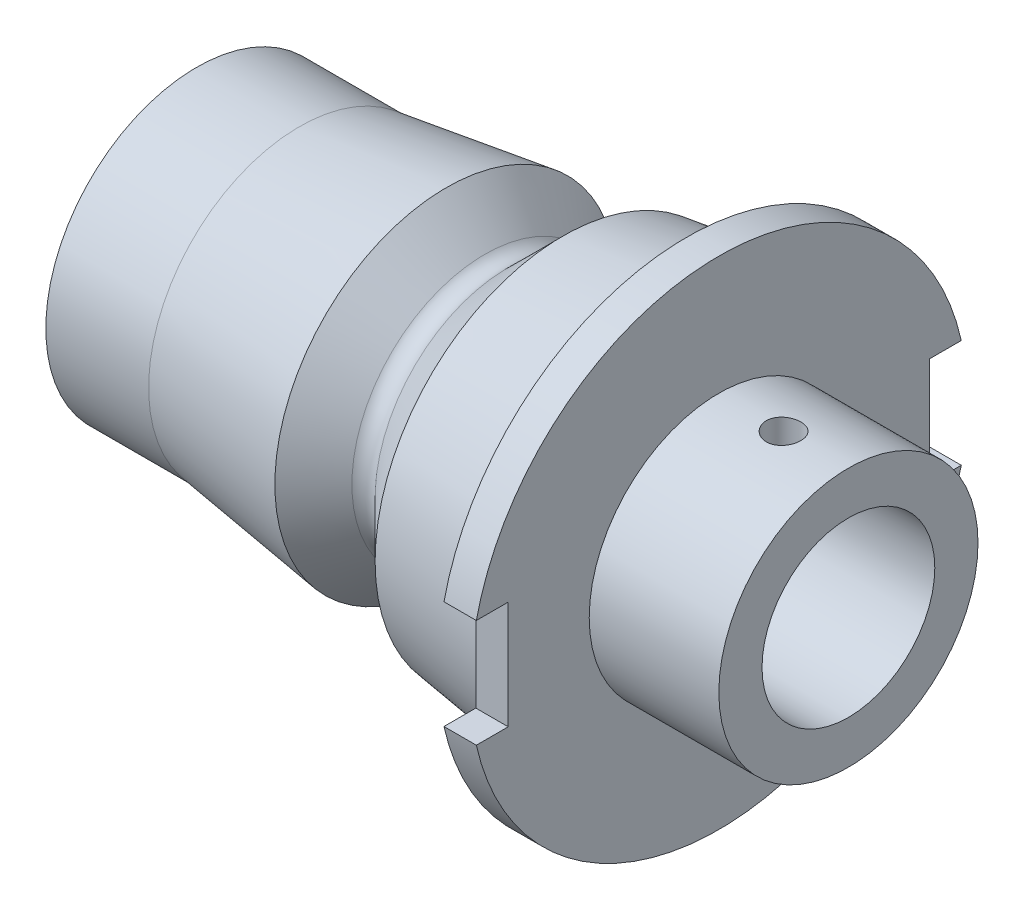
ISO-10303-21;
HEADER;
FILE_DESCRIPTION(('STEP AP214'),'2;1');
FILE_NAME('part.step','',(''),(''),'','','');
FILE_SCHEMA(('AUTOMOTIVE_DESIGN { 1 0 10303 214 1 1 1 1 }'));
ENDSEC;
DATA;
#1=APPLICATION_CONTEXT('core data for automotive mechanical design processes');
#2=APPLICATION_PROTOCOL_DEFINITION('international standard','automotive_design',2000,#1);
#3=PRODUCT_CONTEXT('',#1,'mechanical');
#4=PRODUCT('Part','Part','',(#3));
#5=PRODUCT_RELATED_PRODUCT_CATEGORY('part','',(#4));
#6=PRODUCT_DEFINITION_FORMATION('','',#4);
#7=PRODUCT_DEFINITION_CONTEXT('part definition',#1,'design');
#8=PRODUCT_DEFINITION('design','',#6,#7);
#9=PRODUCT_DEFINITION_SHAPE('','',#8);
#10=(LENGTH_UNIT() NAMED_UNIT(*) SI_UNIT(.MILLI.,.METRE.));
#11=(NAMED_UNIT(*) PLANE_ANGLE_UNIT() SI_UNIT($,.RADIAN.));
#12=(NAMED_UNIT(*) SI_UNIT($,.STERADIAN.) SOLID_ANGLE_UNIT());
#13=UNCERTAINTY_MEASURE_WITH_UNIT(LENGTH_MEASURE(1.E-05),#10,'distance_accuracy_value','');
#14=(GEOMETRIC_REPRESENTATION_CONTEXT(3) GLOBAL_UNCERTAINTY_ASSIGNED_CONTEXT((#13)) GLOBAL_UNIT_ASSIGNED_CONTEXT((#10,
#11,#12)) REPRESENTATION_CONTEXT('',''));
#15=CARTESIAN_POINT('',(0.,0.,0.));
#16=DIRECTION('',(0.,0.,1.));
#17=DIRECTION('',(1.,0.,0.));
#18=AXIS2_PLACEMENT_3D('',#15,#16,#17);
#19=CARTESIAN_POINT('',(24.1765009609634,0.,0.));
#20=DIRECTION('',(1.,0.,0.));
#21=DIRECTION('',(0.,0.,-1.));
#22=AXIS2_PLACEMENT_3D('',#19,#20,#21);
#23=CYLINDRICAL_SURFACE('',#22,11.5);
#24=DIRECTION('',(1.,0.,0.));
#25=VECTOR('',#24,1.);
#26=CARTESIAN_POINT('',(24.1765009609634,2.5,11.2249721603218));
#27=LINE('',#26,#25);
#28=CARTESIAN_POINT('',(24.1765009609634,2.5,11.2249721603218));
#29=VERTEX_POINT('',#28);
#30=CARTESIAN_POINT('',(22.6765009609634,2.5,11.2249721603218));
#31=VERTEX_POINT('',#30);
#32=EDGE_CURVE('E132',#29,#31,#27,.F.);
#33=ORIENTED_EDGE('',*,*,#32,.F.);
#34=CARTESIAN_POINT('',(24.1765009609634,0.,0.));
#35=DIRECTION('',(1.,0.,0.));
#36=DIRECTION('',(0.,0.,-1.));
#37=AXIS2_PLACEMENT_3D('',#34,#35,#36);
#38=CIRCLE('',#37,11.5);
#39=CARTESIAN_POINT('',(24.1765009609634,2.5,-11.2249721603218));
#40=VERTEX_POINT('',#39);
#41=EDGE_CURVE('E156',#40,#29,#38,.T.);
#42=ORIENTED_EDGE('',*,*,#41,.F.);
#43=DIRECTION('',(1.,0.,0.));
#44=VECTOR('',#43,1.);
#45=CARTESIAN_POINT('',(24.1765009609634,2.5,-11.2249721603218));
#46=LINE('',#45,#44);
#47=CARTESIAN_POINT('',(22.6765009609634,2.5,-11.2249721603218));
#48=VERTEX_POINT('',#47);
#49=EDGE_CURVE('E149',#48,#40,#46,.T.);
#50=ORIENTED_EDGE('',*,*,#49,.F.);
#51=CARTESIAN_POINT('',(22.6765009609634,0.,0.));
#52=DIRECTION('',(1.,0.,0.));
#53=DIRECTION('',(0.,0.,-1.));
#54=AXIS2_PLACEMENT_3D('',#51,#52,#53);
#55=CIRCLE('',#54,11.5);
#56=EDGE_CURVE('E159',#48,#31,#55,.T.);
#57=ORIENTED_EDGE('',*,*,#56,.T.);
#58=EDGE_LOOP('',(#33,#42,#50,#57));
#59=FACE_BOUND('',#58,.T.);
#60=ADVANCED_FACE('F35',(#59),#23,.T.);
#61=CARTESIAN_POINT('',(0.,0.,0.));
#62=DIRECTION('',(-1.,0.,0.));
#63=DIRECTION('',(0.,0.,1.));
#64=AXIS2_PLACEMENT_3D('',#61,#62,#63);
#65=PLANE('',#64);
#66=CARTESIAN_POINT('',(0.,0.,0.));
#67=DIRECTION('',(-1.,0.,0.));
#68=DIRECTION('',(0.,0.,1.));
#69=AXIS2_PLACEMENT_3D('',#66,#67,#68);
#70=CIRCLE('',#69,4.);
#71=CARTESIAN_POINT('',(0.,0.,4.));
#72=VERTEX_POINT('',#71);
#73=EDGE_CURVE('E39',#72,#72,#70,.T.);
#74=ORIENTED_EDGE('',*,*,#73,.F.);
#75=EDGE_LOOP('',(#74));
#76=FACE_BOUND('',#75,.T.);
#77=CARTESIAN_POINT('',(0.,0.,0.));
#78=DIRECTION('',(1.,0.,0.));
#79=DIRECTION('',(0.,0.,-1.));
#80=AXIS2_PLACEMENT_3D('',#77,#78,#79);
#81=CIRCLE('',#80,6.982);
#82=CARTESIAN_POINT('',(0.,0.,-6.982));
#83=VERTEX_POINT('',#82);
#84=EDGE_CURVE('E180',#83,#83,#81,.T.);
#85=ORIENTED_EDGE('',*,*,#84,.F.);
#86=EDGE_LOOP('',(#85));
#87=FACE_BOUND('',#86,.T.);
#88=ADVANCED_FACE('F37',(#76,#87),#65,.T.);
#89=CARTESIAN_POINT('',(24.1765009609634,0.,0.));
#90=DIRECTION('',(1.,0.,0.));
#91=DIRECTION('',(0.,0.,-1.));
#92=AXIS2_PLACEMENT_3D('',#89,#90,#91);
#93=CYLINDRICAL_SURFACE('',#92,6.982);
#94=ORIENTED_EDGE('',*,*,#84,.T.);
#95=EDGE_LOOP('',(#94));
#96=FACE_BOUND('',#95,.T.);
#97=CARTESIAN_POINT('',(4.76,0.,0.));
#98=DIRECTION('',(1.,0.,0.));
#99=DIRECTION('',(0.,0.,-1.));
#100=AXIS2_PLACEMENT_3D('',#97,#98,#99);
#101=CIRCLE('',#100,6.982);
#102=CARTESIAN_POINT('',(4.76,0.,-6.982));
#103=VERTEX_POINT('',#102);
#104=EDGE_CURVE('E177',#103,#103,#101,.T.);
#105=ORIENTED_EDGE('',*,*,#104,.F.);
#106=EDGE_LOOP('',(#105));
#107=FACE_BOUND('',#106,.T.);
#108=ADVANCED_FACE('F221',(#96,#107),#93,.T.);
#109=CARTESIAN_POINT('',(11.56,0.,0.));
#110=DIRECTION('',(1.,0.,0.));
#111=DIRECTION('',(0.,0.,-1.));
#112=AXIS2_PLACEMENT_3D('',#109,#110,#111);
#113=CONICAL_SURFACE('',#112,7.93767767597627,0.139626340159547);
#114=ORIENTED_EDGE('',*,*,#104,.T.);
#115=EDGE_LOOP('',(#114));
#116=FACE_BOUND('',#115,.T.);
#117=CARTESIAN_POINT('',(11.56,0.,0.));
#118=DIRECTION('',(1.,0.,0.));
#119=DIRECTION('',(0.,0.,-1.));
#120=AXIS2_PLACEMENT_3D('',#117,#118,#119);
#121=CIRCLE('',#120,7.93767767597627);
#122=CARTESIAN_POINT('',(11.56,0.,-7.93767767597627));
#123=VERTEX_POINT('',#122);
#124=EDGE_CURVE('E174',#123,#123,#121,.T.);
#125=ORIENTED_EDGE('',*,*,#124,.F.);
#126=EDGE_LOOP('',(#125));
#127=FACE_BOUND('',#126,.T.);
#128=ADVANCED_FACE('F247',(#116,#127),#113,.T.);
#129=CARTESIAN_POINT('',(13.3431385926017,0.,0.));
#130=DIRECTION('',(-1.,0.,0.));
#131=DIRECTION('',(0.,0.,1.));
#132=AXIS2_PLACEMENT_3D('',#129,#130,#131);
#133=CONICAL_SURFACE('',#132,6.1545390833745,0.785398163397452);
#134=ORIENTED_EDGE('',*,*,#124,.T.);
#135=EDGE_LOOP('',(#134));
#136=FACE_BOUND('',#135,.T.);
#137=CARTESIAN_POINT('',(13.3431385926017,0.,0.));
#138=DIRECTION('',(1.,0.,0.));
#139=DIRECTION('',(0.,0.,-1.));
#140=AXIS2_PLACEMENT_3D('',#137,#138,#139);
#141=CIRCLE('',#140,6.1545390833745);
#142=CARTESIAN_POINT('',(13.3431385926017,0.,-6.1545390833745));
#143=VERTEX_POINT('',#142);
#144=EDGE_CURVE('E171',#143,#143,#141,.T.);
#145=ORIENTED_EDGE('',*,*,#144,.F.);
#146=EDGE_LOOP('',(#145));
#147=FACE_BOUND('',#146,.T.);
#148=ADVANCED_FACE('F243',(#136,#147),#133,.T.);
#149=CARTESIAN_POINT('',(13.8805397463036,0.,0.));
#150=DIRECTION('',(1.,0.,0.));
#151=DIRECTION('',(0.,0.,-1.));
#152=AXIS2_PLACEMENT_3D('',#149,#150,#151);
#153=TOROIDAL_SURFACE('',#152,6.69194023707633,0.76000000000004);
#154=ORIENTED_EDGE('',*,*,#144,.T.);
#155=EDGE_LOOP('',(#154));
#156=FACE_BOUND('',#155,.T.);
#157=CARTESIAN_POINT('',(14.4179409000054,0.,0.));
#158=DIRECTION('',(1.,0.,0.));
#159=DIRECTION('',(0.,0.,-1.));
#160=AXIS2_PLACEMENT_3D('',#157,#158,#159);
#161=CIRCLE('',#160,6.15453908337452);
#162=CARTESIAN_POINT('',(14.4179409000054,0.,-6.15453908337452));
#163=VERTEX_POINT('',#162);
#164=EDGE_CURVE('E168',#163,#163,#161,.T.);
#165=ORIENTED_EDGE('',*,*,#164,.F.);
#166=EDGE_LOOP('',(#165));
#167=FACE_BOUND('',#166,.T.);
#168=ADVANCED_FACE('F239',(#156,#167),#153,.F.);
#169=CARTESIAN_POINT('',(16.96,0.,0.));
#170=DIRECTION('',(1.,0.,0.));
#171=DIRECTION('',(0.,0.,-1.));
#172=AXIS2_PLACEMENT_3D('',#169,#170,#171);
#173=CONICAL_SURFACE('',#172,8.69659818336918,0.785398163397454);
#174=ORIENTED_EDGE('',*,*,#164,.T.);
#175=EDGE_LOOP('',(#174));
#176=FACE_BOUND('',#175,.T.);
#177=CARTESIAN_POINT('',(16.96,0.,0.));
#178=DIRECTION('',(1.,0.,0.));
#179=DIRECTION('',(0.,0.,-1.));
#180=AXIS2_PLACEMENT_3D('',#177,#178,#179);
#181=CIRCLE('',#180,8.69659818336918);
#182=CARTESIAN_POINT('',(16.96,0.,-8.69659818336918));
#183=VERTEX_POINT('',#182);
#184=EDGE_CURVE('E165',#183,#183,#181,.T.);
#185=ORIENTED_EDGE('',*,*,#184,.F.);
#186=EDGE_LOOP('',(#185));
#187=FACE_BOUND('',#186,.T.);
#188=ADVANCED_FACE('F233',(#176,#187),#173,.T.);
#189=CARTESIAN_POINT('',(22.6765009609634,0.,0.));
#190=DIRECTION('',(1.,0.,0.));
#191=DIRECTION('',(0.,0.,-1.));
#192=AXIS2_PLACEMENT_3D('',#189,#190,#191);
#193=CONICAL_SURFACE('',#192,9.5,0.139626340159547);
#194=ORIENTED_EDGE('',*,*,#184,.T.);
#195=EDGE_LOOP('',(#194));
#196=FACE_BOUND('',#195,.T.);
#197=CARTESIAN_POINT('',(22.6765009609634,0.,0.));
#198=DIRECTION('',(1.,0.,0.));
#199=DIRECTION('',(0.,0.,-1.));
#200=AXIS2_PLACEMENT_3D('',#197,#198,#199);
#201=CIRCLE('',#200,9.5);
#202=CARTESIAN_POINT('',(22.6765009609634,0.,-9.5));
#203=VERTEX_POINT('',#202);
#204=EDGE_CURVE('E162',#203,#203,#201,.T.);
#205=ORIENTED_EDGE('',*,*,#204,.F.);
#206=EDGE_LOOP('',(#205));
#207=FACE_BOUND('',#206,.T.);
#208=ADVANCED_FACE('F229',(#196,#207),#193,.T.);
#209=CARTESIAN_POINT('',(22.6765009609634,9.5,0.));
#210=DIRECTION('',(-1.,0.,0.));
#211=DIRECTION('',(0.,0.,1.));
#212=AXIS2_PLACEMENT_3D('',#209,#210,#211);
#213=PLANE('',#212);
#214=DIRECTION('',(0.,0.,-1.));
#215=VECTOR('',#214,1.);
#216=CARTESIAN_POINT('',(22.6765009609634,2.5,0.));
#217=LINE('',#216,#215);
#218=CARTESIAN_POINT('',(22.6765009609634,2.5,9.75));
#219=VERTEX_POINT('',#218);
#220=EDGE_CURVE('E134',#31,#219,#217,.T.);
#221=ORIENTED_EDGE('',*,*,#220,.F.);
#222=ORIENTED_EDGE('',*,*,#56,.F.);
#223=DIRECTION('',(0.,0.,-1.));
#224=VECTOR('',#223,1.);
#225=CARTESIAN_POINT('',(22.6765009609634,2.5,0.));
#226=LINE('',#225,#224);
#227=CARTESIAN_POINT('',(22.6765009609634,2.5,-9.75));
#228=VERTEX_POINT('',#227);
#229=EDGE_CURVE('E151',#228,#48,#226,.T.);
#230=ORIENTED_EDGE('',*,*,#229,.F.);
#231=DIRECTION('',(0.,1.,0.));
#232=VECTOR('',#231,1.);
#233=CARTESIAN_POINT('',(22.6765009609634,9.5,-9.75));
#234=LINE('',#233,#232);
#235=CARTESIAN_POINT('',(22.6765009609634,-2.5,-9.75));
#236=VERTEX_POINT('',#235);
#237=EDGE_CURVE('E153',#236,#228,#234,.T.);
#238=ORIENTED_EDGE('',*,*,#237,.F.);
#239=DIRECTION('',(0.,0.,1.));
#240=VECTOR('',#239,1.);
#241=CARTESIAN_POINT('',(22.6765009609634,-2.5,0.));
#242=LINE('',#241,#240);
#243=CARTESIAN_POINT('',(22.6765009609634,-2.5,-11.2249721603218));
#244=VERTEX_POINT('',#243);
#245=EDGE_CURVE('E147',#244,#236,#242,.T.);
#246=ORIENTED_EDGE('',*,*,#245,.F.);
#247=CARTESIAN_POINT('',(22.6765009609634,-2.5,11.2249721603218));
#248=VERTEX_POINT('',#247);
#249=EDGE_CURVE('E158',#248,#244,#55,.T.);
#250=ORIENTED_EDGE('',*,*,#249,.F.);
#251=DIRECTION('',(0.,0.,1.));
#252=VECTOR('',#251,1.);
#253=CARTESIAN_POINT('',(22.6765009609634,-2.5,0.));
#254=LINE('',#253,#252);
#255=CARTESIAN_POINT('',(22.6765009609634,-2.5,9.75));
#256=VERTEX_POINT('',#255);
#257=EDGE_CURVE('E129',#256,#248,#254,.T.);
#258=ORIENTED_EDGE('',*,*,#257,.F.);
#259=DIRECTION('',(0.,-1.,0.));
#260=VECTOR('',#259,1.);
#261=CARTESIAN_POINT('',(22.6765009609634,9.5,9.75));
#262=LINE('',#261,#260);
#263=EDGE_CURVE('E109',#219,#256,#262,.T.);
#264=ORIENTED_EDGE('',*,*,#263,.F.);
#265=EDGE_LOOP('',(#221,#222,#230,#238,#246,#250,#258,#264));
#266=FACE_BOUND('',#265,.T.);
#267=ORIENTED_EDGE('',*,*,#204,.T.);
#268=EDGE_LOOP('',(#267));
#269=FACE_BOUND('',#268,.T.);
#270=ADVANCED_FACE('F201',(#266,#269),#213,.T.);
#271=DIRECTION('',(1.,0.,0.));
#272=VECTOR('',#271,1.);
#273=CARTESIAN_POINT('',(24.1765009609634,-2.5,11.2249721603218));
#274=LINE('',#273,#272);
#275=CARTESIAN_POINT('',(24.1765009609634,-2.50000000000001,11.2249721603218));
#276=VERTEX_POINT('',#275);
#277=EDGE_CURVE('E50',#248,#276,#274,.T.);
#278=ORIENTED_EDGE('',*,*,#277,.F.);
#279=ORIENTED_EDGE('',*,*,#249,.T.);
#280=DIRECTION('',(1.,0.,0.));
#281=VECTOR('',#280,1.);
#282=CARTESIAN_POINT('',(24.1765009609634,-2.5,-11.2249721603218));
#283=LINE('',#282,#281);
#284=CARTESIAN_POINT('',(24.1765009609634,-2.5,-11.2249721603218));
#285=VERTEX_POINT('',#284);
#286=EDGE_CURVE('E143',#285,#244,#283,.F.);
#287=ORIENTED_EDGE('',*,*,#286,.F.);
#288=EDGE_CURVE('E155',#276,#285,#38,.T.);
#289=ORIENTED_EDGE('',*,*,#288,.F.);
#290=EDGE_LOOP('',(#278,#279,#287,#289));
#291=FACE_BOUND('',#290,.T.);
#292=ADVANCED_FACE('F197',(#291),#23,.T.);
#293=CARTESIAN_POINT('',(24.1765009609634,11.5,0.));
#294=DIRECTION('',(1.,0.,0.));
#295=DIRECTION('',(0.,0.,-1.));
#296=AXIS2_PLACEMENT_3D('',#293,#294,#295);
#297=PLANE('',#296);
#298=CARTESIAN_POINT('',(24.1765009609634,0.,0.));
#299=DIRECTION('',(1.,0.,0.));
#300=DIRECTION('',(0.,0.,-1.));
#301=AXIS2_PLACEMENT_3D('',#298,#299,#300);
#302=CIRCLE('',#301,6.);
#303=CARTESIAN_POINT('',(24.1765009609634,0.,-6.));
#304=VERTEX_POINT('',#303);
#305=EDGE_CURVE('E123',#304,#304,#302,.T.);
#306=ORIENTED_EDGE('',*,*,#305,.F.);
#307=EDGE_LOOP('',(#306));
#308=FACE_BOUND('',#307,.T.);
#309=DIRECTION('',(0.,0.,1.));
#310=VECTOR('',#309,1.);
#311=CARTESIAN_POINT('',(24.1765009609634,2.5,11.75));
#312=LINE('',#311,#310);
#313=CARTESIAN_POINT('',(24.1765009609634,2.5,9.75));
#314=VERTEX_POINT('',#313);
#315=EDGE_CURVE('E112',#314,#29,#312,.T.);
#316=ORIENTED_EDGE('',*,*,#315,.F.);
#317=DIRECTION('',(0.,1.,0.));
#318=VECTOR('',#317,1.);
#319=CARTESIAN_POINT('',(24.1765009609634,2.5,9.75));
#320=LINE('',#319,#318);
#321=CARTESIAN_POINT('',(24.1765009609634,-2.5,9.75));
#322=VERTEX_POINT('',#321);
#323=EDGE_CURVE('E106',#322,#314,#320,.T.);
#324=ORIENTED_EDGE('',*,*,#323,.F.);
#325=DIRECTION('',(0.,0.,-1.));
#326=VECTOR('',#325,1.);
#327=CARTESIAN_POINT('',(24.1765009609634,-2.5,0.));
#328=LINE('',#327,#326);
#329=EDGE_CURVE('E11',#276,#322,#328,.T.);
#330=ORIENTED_EDGE('',*,*,#329,.F.);
#331=ORIENTED_EDGE('',*,*,#288,.T.);
#332=DIRECTION('',(0.,0.,-1.));
#333=VECTOR('',#332,1.);
#334=CARTESIAN_POINT('',(24.1765009609634,-2.5,-9.75));
#335=LINE('',#334,#333);
#336=CARTESIAN_POINT('',(24.1765009609634,-2.5,-9.75));
#337=VERTEX_POINT('',#336);
#338=EDGE_CURVE('E137',#337,#285,#335,.T.);
#339=ORIENTED_EDGE('',*,*,#338,.F.);
#340=DIRECTION('',(0.,-1.,0.));
#341=VECTOR('',#340,1.);
#342=CARTESIAN_POINT('',(24.1765009609634,2.5,-9.75));
#343=LINE('',#342,#341);
#344=CARTESIAN_POINT('',(24.1765009609634,2.5,-9.75));
#345=VERTEX_POINT('',#344);
#346=EDGE_CURVE('E58',#345,#337,#343,.T.);
#347=ORIENTED_EDGE('',*,*,#346,.F.);
#348=DIRECTION('',(0.,0.,1.));
#349=VECTOR('',#348,1.);
#350=CARTESIAN_POINT('',(24.1765009609634,2.5,0.));
#351=LINE('',#350,#349);
#352=EDGE_CURVE('E44',#40,#345,#351,.T.);
#353=ORIENTED_EDGE('',*,*,#352,.F.);
#354=ORIENTED_EDGE('',*,*,#41,.T.);
#355=EDGE_LOOP('',(#316,#324,#330,#331,#339,#347,#353,#354));
#356=FACE_BOUND('',#355,.T.);
#357=ADVANCED_FACE('F117',(#308,#356),#297,.T.);
#358=CARTESIAN_POINT('',(0.,2.5,-9.75));
#359=DIRECTION('',(0.,0.,1.));
#360=DIRECTION('',(1.,0.,0.));
#361=AXIS2_PLACEMENT_3D('',#358,#359,#360);
#362=PLANE('',#361);
#363=ORIENTED_EDGE('',*,*,#237,.T.);
#364=DIRECTION('',(1.,0.,0.));
#365=VECTOR('',#364,1.);
#366=CARTESIAN_POINT('',(0.,2.5,-9.75));
#367=LINE('',#366,#365);
#368=EDGE_CURVE('E141',#228,#345,#367,.T.);
#369=ORIENTED_EDGE('',*,*,#368,.T.);
#370=ORIENTED_EDGE('',*,*,#346,.T.);
#371=DIRECTION('',(1.,0.,0.));
#372=VECTOR('',#371,1.);
#373=CARTESIAN_POINT('',(0.,-2.5,-9.75));
#374=LINE('',#373,#372);
#375=EDGE_CURVE('E140',#236,#337,#374,.T.);
#376=ORIENTED_EDGE('',*,*,#375,.F.);
#377=EDGE_LOOP('',(#363,#369,#370,#376));
#378=FACE_BOUND('',#377,.T.);
#379=ADVANCED_FACE('F204',(#378),#362,.F.);
#380=CARTESIAN_POINT('',(0.,2.5,-9.75));
#381=DIRECTION('',(0.,1.,0.));
#382=DIRECTION('',(0.,0.,1.));
#383=AXIS2_PLACEMENT_3D('',#380,#381,#382);
#384=PLANE('',#383);
#385=ORIENTED_EDGE('',*,*,#229,.T.);
#386=ORIENTED_EDGE('',*,*,#49,.T.);
#387=ORIENTED_EDGE('',*,*,#352,.T.);
#388=ORIENTED_EDGE('',*,*,#368,.F.);
#389=EDGE_LOOP('',(#385,#386,#387,#388));
#390=FACE_BOUND('',#389,.T.);
#391=ADVANCED_FACE('F187',(#390),#384,.F.);
#392=CARTESIAN_POINT('',(0.,-2.5,-9.75));
#393=DIRECTION('',(0.,-1.,0.));
#394=DIRECTION('',(0.,0.,-1.));
#395=AXIS2_PLACEMENT_3D('',#392,#393,#394);
#396=PLANE('',#395);
#397=ORIENTED_EDGE('',*,*,#245,.T.);
#398=ORIENTED_EDGE('',*,*,#375,.T.);
#399=ORIENTED_EDGE('',*,*,#338,.T.);
#400=ORIENTED_EDGE('',*,*,#286,.T.);
#401=EDGE_LOOP('',(#397,#398,#399,#400));
#402=FACE_BOUND('',#401,.T.);
#403=ADVANCED_FACE('F194',(#402),#396,.F.);
#404=CARTESIAN_POINT('',(0.,2.5,11.75));
#405=DIRECTION('',(0.,1.,0.));
#406=DIRECTION('',(0.,0.,1.));
#407=AXIS2_PLACEMENT_3D('',#404,#405,#406);
#408=PLANE('',#407);
#409=ORIENTED_EDGE('',*,*,#220,.T.);
#410=DIRECTION('',(1.,0.,0.));
#411=VECTOR('',#410,1.);
#412=CARTESIAN_POINT('',(0.,2.5,9.75));
#413=LINE('',#412,#411);
#414=EDGE_CURVE('E111',#219,#314,#413,.T.);
#415=ORIENTED_EDGE('',*,*,#414,.T.);
#416=ORIENTED_EDGE('',*,*,#315,.T.);
#417=ORIENTED_EDGE('',*,*,#32,.T.);
#418=EDGE_LOOP('',(#409,#415,#416,#417));
#419=FACE_BOUND('',#418,.T.);
#420=ADVANCED_FACE('F323',(#419),#408,.F.);
#421=CARTESIAN_POINT('',(0.,2.5,9.75));
#422=DIRECTION('',(0.,0.,-1.));
#423=DIRECTION('',(-1.,0.,0.));
#424=AXIS2_PLACEMENT_3D('',#421,#422,#423);
#425=PLANE('',#424);
#426=ORIENTED_EDGE('',*,*,#263,.T.);
#427=DIRECTION('',(1.,0.,0.));
#428=VECTOR('',#427,1.);
#429=CARTESIAN_POINT('',(0.,-2.5,9.75));
#430=LINE('',#429,#428);
#431=EDGE_CURVE('E102',#256,#322,#430,.T.);
#432=ORIENTED_EDGE('',*,*,#431,.T.);
#433=ORIENTED_EDGE('',*,*,#323,.T.);
#434=ORIENTED_EDGE('',*,*,#414,.F.);
#435=EDGE_LOOP('',(#426,#432,#433,#434));
#436=FACE_BOUND('',#435,.T.);
#437=ADVANCED_FACE('F103',(#436),#425,.F.);
#438=CARTESIAN_POINT('',(0.,-2.5,11.75));
#439=DIRECTION('',(0.,-1.,0.));
#440=DIRECTION('',(0.,0.,-1.));
#441=AXIS2_PLACEMENT_3D('',#438,#439,#440);
#442=PLANE('',#441);
#443=ORIENTED_EDGE('',*,*,#257,.T.);
#444=ORIENTED_EDGE('',*,*,#277,.T.);
#445=ORIENTED_EDGE('',*,*,#329,.T.);
#446=ORIENTED_EDGE('',*,*,#431,.F.);
#447=EDGE_LOOP('',(#443,#444,#445,#446));
#448=FACE_BOUND('',#447,.T.);
#449=ADVANCED_FACE('F114',(#448),#442,.F.);
#450=CARTESIAN_POINT('',(30.1765009609634,0.,0.));
#451=DIRECTION('',(1.,0.,0.));
#452=DIRECTION('',(0.,0.,-1.));
#453=AXIS2_PLACEMENT_3D('',#450,#451,#452);
#454=PLANE('',#453);
#455=CARTESIAN_POINT('',(30.1765009609634,0.,0.));
#456=DIRECTION('',(1.,0.,0.));
#457=DIRECTION('',(0.,0.,-1.));
#458=AXIS2_PLACEMENT_3D('',#455,#456,#457);
#459=CIRCLE('',#458,6.);
#460=CARTESIAN_POINT('',(30.1765009609634,0.,-6.));
#461=VERTEX_POINT('',#460);
#462=EDGE_CURVE('E119',#461,#461,#459,.T.);
#463=ORIENTED_EDGE('',*,*,#462,.T.);
#464=EDGE_LOOP('',(#463));
#465=FACE_BOUND('',#464,.T.);
#466=CARTESIAN_POINT('',(30.1765009609634,0.,0.));
#467=DIRECTION('',(1.,0.,0.));
#468=DIRECTION('',(0.,0.,-1.));
#469=AXIS2_PLACEMENT_3D('',#466,#467,#468);
#470=CIRCLE('',#469,4.);
#471=CARTESIAN_POINT('',(30.1765009609634,0.,-4.));
#472=VERTEX_POINT('',#471);
#473=EDGE_CURVE('E429',#472,#472,#470,.T.);
#474=ORIENTED_EDGE('',*,*,#473,.F.);
#475=EDGE_LOOP('',(#474));
#476=FACE_BOUND('',#475,.T.);
#477=ADVANCED_FACE('F348',(#465,#476),#454,.T.);
#478=CARTESIAN_POINT('',(30.1765009609634,0.,0.));
#479=DIRECTION('',(-1.,0.,0.));
#480=DIRECTION('',(0.,0.,1.));
#481=AXIS2_PLACEMENT_3D('',#478,#479,#480);
#482=CYLINDRICAL_SURFACE('',#481,6.);
#483=CARTESIAN_POINT('',(27.1765009609634,5.9464274989274,0.799999999999993));
#484=CARTESIAN_POINT('',(27.1317794187793,5.94642817813305,0.799998114379362));
#485=CARTESIAN_POINT('',(27.0870305477263,5.94693745897463,0.796237306818271));
#486=CARTESIAN_POINT('',(26.9987799760378,5.94891859481411,0.781295185066212));
#487=CARTESIAN_POINT('',(26.9552795989983,5.95039143464563,0.770106278596623));
#488=CARTESIAN_POINT('',(26.8708164136698,5.95412996846747,0.740645244560404));
#489=CARTESIAN_POINT('',(26.8298518363155,5.95639510221776,0.722378121099998));
#490=CARTESIAN_POINT('',(26.7515765306804,5.96146232903785,0.679290259522911));
#491=CARTESIAN_POINT('',(26.7142652173884,5.96426433592291,0.654470573053916));
#492=CARTESIAN_POINT('',(26.6441115790958,5.9701095092747,0.598813481958019));
#493=CARTESIAN_POINT('',(26.6112958146916,5.97315395397272,0.567942729099421));
#494=CARTESIAN_POINT('',(26.5512944627809,5.97912950503515,0.50113169149045));
#495=CARTESIAN_POINT('',(26.5241091643729,5.98206060557357,0.465191146588792));
#496=CARTESIAN_POINT('',(26.4760442242768,5.98749239904087,0.389092689971037));
#497=CARTESIAN_POINT('',(26.4551887652473,5.98999142600895,0.348919375084484));
#498=CARTESIAN_POINT('',(26.4205304952911,5.9942634136634,0.265601526414945));
#499=CARTESIAN_POINT('',(26.4067273880123,5.99603640485843,0.222457117568959));
#500=CARTESIAN_POINT('',(26.3866453971313,5.99864754478239,0.134694150005635));
#501=CARTESIAN_POINT('',(26.3803222349586,5.99949119282029,0.0900858893879591));
#502=CARTESIAN_POINT('',(26.3752423174687,6.00016739188608,0.000434000921463619));
#503=CARTESIAN_POINT('',(26.3764852258688,5.99999998785132,-0.0446096074889851));
#504=CARTESIAN_POINT('',(26.3864668531798,5.99867737646763,-0.133552049786306));
#505=CARTESIAN_POINT('',(26.3951579468616,5.99752844535123,-0.177456334944713));
#506=CARTESIAN_POINT('',(26.419714691772,5.99437889636916,-0.26317764908502));
#507=CARTESIAN_POINT('',(26.4355804950306,5.99237826045613,-0.304994633816733));
#508=CARTESIAN_POINT('',(26.4740863374121,5.98773927601666,-0.385500723369648));
#509=CARTESIAN_POINT('',(26.4967468102366,5.98509900858352,-0.424179939741301));
#510=CARTESIAN_POINT('',(26.5481838638765,5.97947580167616,-0.49720467629391));
#511=CARTESIAN_POINT('',(26.5769607636145,5.97649284433716,-0.531549970346721));
#512=CARTESIAN_POINT('',(26.640080100307,5.97049035238265,-0.595212024618148));
#513=CARTESIAN_POINT('',(26.6744640682408,5.9674707136976,-0.624487613412079));
#514=CARTESIAN_POINT('',(26.7476793335124,5.96175799507695,-0.676858772228758));
#515=CARTESIAN_POINT('',(26.7865106484846,5.9590649164363,-0.699954317745405));
#516=CARTESIAN_POINT('',(26.8675569611021,5.95431030533736,-0.739313144345993));
#517=CARTESIAN_POINT('',(26.9097737227708,5.95224910485915,-0.755572835626819));
#518=CARTESIAN_POINT('',(26.9963721692187,5.94899790186288,-0.780760360179689));
#519=CARTESIAN_POINT('',(27.040753734574,5.94780785134465,-0.789688597416567));
#520=CARTESIAN_POINT('',(27.1300574949654,5.94644258004139,-0.799904643074901));
#521=CARTESIAN_POINT('',(27.1749729330964,5.94625964604651,-0.801250524395242));
#522=CARTESIAN_POINT('',(27.2643886634053,5.94690889718679,-0.796417152755177));
#523=CARTESIAN_POINT('',(27.3088889656592,5.947741057619,-0.790238082919099));
#524=CARTESIAN_POINT('',(27.3960353555256,5.95031968174708,-0.770579220148072));
#525=CARTESIAN_POINT('',(27.4386879581706,5.9520625911506,-0.757127801293433));
#526=CARTESIAN_POINT('',(27.5211325263443,5.95626343605763,-0.723335380320496));
#527=CARTESIAN_POINT('',(27.5609243782929,5.95872139993137,-0.702994104837528));
#528=CARTESIAN_POINT('',(27.6367798851397,5.96409378647807,-0.655857625668838));
#529=CARTESIAN_POINT('',(27.6728197803107,5.96701085515654,-0.629024492665195));
#530=CARTESIAN_POINT('',(27.7399053363382,5.97296457406604,-0.569719329251189));
#531=CARTESIAN_POINT('',(27.7709507754226,5.97600122959974,-0.537247048575011));
#532=CARTESIAN_POINT('',(27.8273715825318,5.98187579462133,-0.467331019343291));
#533=CARTESIAN_POINT('',(27.852708687512,5.98471228019887,-0.429856256373005));
#534=CARTESIAN_POINT('',(27.8967282738335,5.98984536591321,-0.351148980927043));
#535=CARTESIAN_POINT('',(27.9154109048658,5.99214197819397,-0.309916553005475));
#536=CARTESIAN_POINT('',(27.9455286655986,5.99593025876462,-0.22498910900937));
#537=CARTESIAN_POINT('',(27.9569855325968,5.99742433928313,-0.181301913698941));
#538=CARTESIAN_POINT('',(27.9723971551478,5.99944926674647,-0.0926025973692777));
#539=CARTESIAN_POINT('',(27.9763522980465,5.9999801634245,-0.0475905448799288));
#540=CARTESIAN_POINT('',(27.9766402678595,6.00001858899368,0.0421079494846345));
#541=CARTESIAN_POINT('',(27.9730319492011,5.99953401965371,0.0867942103687507));
#542=CARTESIAN_POINT('',(27.9584205444706,5.99761173287944,0.174918977220939));
#543=CARTESIAN_POINT('',(27.9474174687549,5.99617401678004,0.218357484936416));
#544=CARTESIAN_POINT('',(27.9183481421327,5.99250622656988,0.302743293835541));
#545=CARTESIAN_POINT('',(27.9002851104002,5.99027651363326,0.343691720617562));
#546=CARTESIAN_POINT('',(27.8576147411051,5.98527099758394,0.421985631452347));
#547=CARTESIAN_POINT('',(27.8330072827024,5.98249518438796,0.459331048959663));
#548=CARTESIAN_POINT('',(27.7777302881619,5.97668116483941,0.529658914426692));
#549=CARTESIAN_POINT('',(27.7470170449077,5.97364116119964,0.562606862865597));
#550=CARTESIAN_POINT('',(27.6804917333444,5.96765545958707,0.62290358234886));
#551=CARTESIAN_POINT('',(27.6446784633949,5.96470978404026,0.650251030120919));
#552=CARTESIAN_POINT('',(27.568787384335,5.95923243954024,0.698675163913976));
#553=CARTESIAN_POINT('',(27.5286915243594,5.95670264704317,0.719723761716506));
#554=CARTESIAN_POINT('',(27.4455215739565,5.95236546633496,0.754758073125947));
#555=CARTESIAN_POINT('',(27.4024507330595,5.95055730408915,0.768751358665429));
#556=CARTESIAN_POINT('',(27.3287216494732,5.94830053529977,0.785981921514345));
#557=CARTESIAN_POINT('',(27.2985256517764,5.94760171448888,0.791230992543266));
#558=CARTESIAN_POINT('',(27.2377243571749,5.94666496589785,0.798240661372657));
#559=CARTESIAN_POINT('',(27.2071190640035,5.94642703391687,0.800001290969042));
#560=CARTESIAN_POINT('',(27.1765009609634,5.9464274989274,0.799999999999993));
#561=B_SPLINE_CURVE_WITH_KNOTS('',3,(#483,#484,#485,#486,#487,#488,#489,#490,#491,#492,#493,
#494,#495,#496,#497,#498,#499,#500,#501,#502,#503,#504,#505,#506,#507,#508,#509,#510,#511,#512,
#513,#514,#515,#516,#517,#518,#519,#520,#521,#522,#523,#524,#525,#526,#527,#528,#529,#530,#531,
#532,#533,#534,#535,#536,#537,#538,#539,#540,#541,#542,#543,#544,#545,#546,#547,#548,#549,#550,
#551,#552,#553,#554,#555,#556,#557,#558,#559,#560),.UNSPECIFIED.,.T.,.F.,(4,2,2,2,2,2,2,2,2,2,2,
2,2,2,2,2,2,2,2,2,2,2,2,2,2,2,2,2,2,2,2,2,2,2,2,2,2,2,4),(0.,0.134052755695637,
0.268242738433454,0.402338025098482,0.536411803331005,0.671246380475837,0.806087879040131,
0.941438226091762,1.07678288501888,1.21132227809105,1.3458556914506,1.47953523467098,
1.61321761065788,1.74730611381617,1.88140161032968,2.016539660267,2.15167824606753,
2.28688771061413,2.42208972458757,2.55625481031888,2.69041663112533,2.82405873926554,
2.95770615046399,3.09215411256049,3.22660804299364,3.36193804704917,3.49726500669177,
3.63218289507249,3.76709381687974,3.90095883941635,4.03482367447371,4.16862754139193,
4.30243387911546,4.43723496946692,4.57206787362875,4.70749336791954,4.8427732092441,
4.93455176376816,5.02632948175918),.UNSPECIFIED.);
#562=CARTESIAN_POINT('',(27.1765009609634,5.9464274989274,0.799999999999993));
#563=VERTEX_POINT('',#562);
#564=EDGE_CURVE('E424',#563,#563,#561,.T.);
#565=ORIENTED_EDGE('',*,*,#564,.T.);
#566=EDGE_LOOP('',(#565));
#567=FACE_BOUND('',#566,.T.);
#568=ORIENTED_EDGE('',*,*,#462,.F.);
#569=EDGE_LOOP('',(#568));
#570=FACE_BOUND('',#569,.T.);
#571=ORIENTED_EDGE('',*,*,#305,.T.);
#572=EDGE_LOOP('',(#571));
#573=FACE_BOUND('',#572,.T.);
#574=ADVANCED_FACE('F361',(#567,#570,#573),#482,.T.);
#575=CARTESIAN_POINT('',(30.1765009609634,0.,0.));
#576=DIRECTION('',(-1.,0.,0.));
#577=DIRECTION('',(0.,0.,1.));
#578=AXIS2_PLACEMENT_3D('',#575,#576,#577);
#579=CYLINDRICAL_SURFACE('',#578,4.);
#580=CARTESIAN_POINT('',(27.1765009609634,3.91918358845309,0.799999999999993));
#581=CARTESIAN_POINT('',(27.1320494605778,3.91918447235146,0.79999835670083));
#582=CARTESIAN_POINT('',(27.0875772623182,3.91994806677531,0.796282537378918));
#583=CARTESIAN_POINT('',(26.9998909568687,3.9229154510821,0.781529826870662));
#584=CARTESIAN_POINT('',(26.9566778852585,3.92512039333066,0.770487077656938));
#585=CARTESIAN_POINT('',(26.872791118273,3.93071098960285,0.741436626094184));
#586=CARTESIAN_POINT('',(26.8321149437354,3.9340954689225,0.72343585132166));
#587=CARTESIAN_POINT('',(26.7543610852077,3.94166239589137,0.680999286136829));
#588=CARTESIAN_POINT('',(26.7172832005336,3.94584479900011,0.656563854881031));
#589=CARTESIAN_POINT('',(26.6472521578798,3.95460239754144,0.601583260522626));
#590=CARTESIAN_POINT('',(26.6143572906561,3.9591819026946,0.570964524730618));
#591=CARTESIAN_POINT('',(26.5541349341003,3.96817977842416,0.504645431217074));
#592=CARTESIAN_POINT('',(26.5268078350297,3.97259813768756,0.46894471758239));
#593=CARTESIAN_POINT('',(26.4782705468606,3.98082237133958,0.393089084739389));
#594=CARTESIAN_POINT('',(26.4571157499101,3.98462257153216,0.35289805413776));
#595=CARTESIAN_POINT('',(26.4218810113249,3.9911338950693,0.269443320309814));
#596=CARTESIAN_POINT('',(26.4078004074426,3.99384512035302,0.226179905136439));
#597=CARTESIAN_POINT('',(26.3872952060677,3.99784256550728,0.138413418622793));
#598=CARTESIAN_POINT('',(26.3807721789066,3.999147090305,0.0939341913718493));
#599=CARTESIAN_POINT('',(26.3752601994927,4.00024736946885,0.00449485475002851));
#600=CARTESIAN_POINT('',(26.3762705212467,4.00004326922208,-0.0404652078654746));
#601=CARTESIAN_POINT('',(26.3857219051358,3.99816347894812,-0.12891360059487));
#602=CARTESIAN_POINT('',(26.3940569426977,3.99650878692671,-0.172413771438775));
#603=CARTESIAN_POINT('',(26.4177529869305,3.99193741727527,-0.257385301264239));
#604=CARTESIAN_POINT('',(26.4331142747169,3.98902068915231,-0.298856578997701));
#605=CARTESIAN_POINT('',(26.4705249930812,3.98221836815967,-0.378895570560707));
#606=CARTESIAN_POINT('',(26.4926159618473,3.97832678540179,-0.417443339307117));
#607=CARTESIAN_POINT('',(26.5428282227527,3.97000375579028,-0.490324036687801));
#608=CARTESIAN_POINT('',(26.5709502087798,3.96557224684178,-0.524656479619996));
#609=CARTESIAN_POINT('',(26.6330078586502,3.95656771491568,-0.588761144842762));
#610=CARTESIAN_POINT('',(26.6670363103471,3.95199357166013,-0.618443453258902));
#611=CARTESIAN_POINT('',(26.739634114924,3.94329257279009,-0.671694794541442));
#612=CARTESIAN_POINT('',(26.7782035536699,3.93916572563639,-0.695263711782196));
#613=CARTESIAN_POINT('',(26.8589176264208,3.93182437978339,-0.7356502518415));
#614=CARTESIAN_POINT('',(26.9010697350751,3.92861185250839,-0.752453318222162));
#615=CARTESIAN_POINT('',(26.9876780199426,3.92349181057018,-0.778712273302059));
#616=CARTESIAN_POINT('',(27.0321338950587,3.92158412582742,-0.788169119565307));
#617=CARTESIAN_POINT('',(27.1212728473626,3.91932383414262,-0.799332804828834));
#618=CARTESIAN_POINT('',(27.1659390204117,3.91894517645724,-0.801169487118323));
#619=CARTESIAN_POINT('',(27.2549395395231,3.91971588551083,-0.797390102648584));
#620=CARTESIAN_POINT('',(27.2992739042585,3.92086516560311,-0.791774458497947));
#621=CARTESIAN_POINT('',(27.3859158731972,3.92453785995932,-0.773361766459319));
#622=CARTESIAN_POINT('',(27.428238835392,3.92704799211597,-0.760634096671433));
#623=CARTESIAN_POINT('',(27.5101515841864,3.93314791481332,-0.728432828246809));
#624=CARTESIAN_POINT('',(27.549741145312,3.93673779429016,-0.708958673898536));
#625=CARTESIAN_POINT('',(27.6256314489235,3.94465124769632,-0.663523313772473));
#626=CARTESIAN_POINT('',(27.661882598004,3.94898377491923,-0.637480862386198));
#627=CARTESIAN_POINT('',(27.7295476105641,3.95786979061309,-0.579756457770165));
#628=CARTESIAN_POINT('',(27.7609609755628,3.96242330179054,-0.548073924115625));
#629=CARTESIAN_POINT('',(27.8185510083118,3.97132276695372,-0.479385818798309));
#630=CARTESIAN_POINT('',(27.8446398846834,3.97566446166947,-0.442305999143701));
#631=CARTESIAN_POINT('',(27.890217666163,3.98357702102896,-0.364214317307802));
#632=CARTESIAN_POINT('',(27.9097068484392,3.98714791804169,-0.323202620346803));
#633=CARTESIAN_POINT('',(27.9414040583607,3.99309835248853,-0.238642144659208));
#634=CARTESIAN_POINT('',(27.9536533755444,3.99548463314083,-0.195109338782461));
#635=CARTESIAN_POINT('',(27.9706539590945,3.99882588750128,-0.106551563743929));
#636=CARTESIAN_POINT('',(27.9754061285439,3.99978103359875,-0.0615267749689713));
#637=CARTESIAN_POINT('',(27.9772425457337,4.00014832363297,0.0278983151228979));
#638=CARTESIAN_POINT('',(27.9744587853283,3.99958702839481,0.0722958497132007));
#639=CARTESIAN_POINT('',(27.9615938005251,3.99704034848254,0.159976825052512));
#640=CARTESIAN_POINT('',(27.9515126678849,3.99505498171481,0.203260279802951));
#641=CARTESIAN_POINT('',(27.9243977672901,3.98988398692,0.287402199796075));
#642=CARTESIAN_POINT('',(27.9073798584584,3.9867010979833,0.328265954592223));
#643=CARTESIAN_POINT('',(27.8668911678987,3.97947777698706,0.40657697614876));
#644=CARTESIAN_POINT('',(27.8434198762404,3.97543727716702,0.444023972613926));
#645=CARTESIAN_POINT('',(27.7902454513137,3.96686079326295,0.515091112085082));
#646=CARTESIAN_POINT('',(27.760447891854,3.96231786737714,0.548639772893198));
#647=CARTESIAN_POINT('',(27.6956607688868,3.95328978322898,0.610306094205471));
#648=CARTESIAN_POINT('',(27.6606699773884,3.948804638903,0.638422466562164));
#649=CARTESIAN_POINT('',(27.5860375076032,3.94034674199971,0.688713775564155));
#650=CARTESIAN_POINT('',(27.5463497920351,3.93638002905062,0.710821451711808));
#651=CARTESIAN_POINT('',(27.4637547423236,3.92948189747556,0.74801923943024));
#652=CARTESIAN_POINT('',(27.420850370005,3.92654954029565,0.763115716783425));
#653=CARTESIAN_POINT('',(27.3442909966141,3.92263744903138,0.782935311883411));
#654=CARTESIAN_POINT('',(27.3110726253542,3.92135027932529,0.789323118818382));
#655=CARTESIAN_POINT('',(27.2440737973205,3.91962302766424,0.797856014368321));
#656=CARTESIAN_POINT('',(27.2102933599648,3.91918291650622,0.800001249249637));
#657=CARTESIAN_POINT('',(27.1765009609634,3.91918358845309,0.799999999999993));
#658=B_SPLINE_CURVE_WITH_KNOTS('',3,(#580,#581,#582,#583,#584,#585,#586,#587,#588,#589,#590,
#591,#592,#593,#594,#595,#596,#597,#598,#599,#600,#601,#602,#603,#604,#605,#606,#607,#608,#609,
#610,#611,#612,#613,#614,#615,#616,#617,#618,#619,#620,#621,#622,#623,#624,#625,#626,#627,#628,
#629,#630,#631,#632,#633,#634,#635,#636,#637,#638,#639,#640,#641,#642,#643,#644,#645,#646,#647,
#648,#649,#650,#651,#652,#653,#654,#655,#656,#657),.UNSPECIFIED.,.T.,.F.,(4,2,2,2,2,2,2,2,2,2,2,
2,2,2,2,2,2,2,2,2,2,2,2,2,2,2,2,2,2,2,2,2,2,2,2,2,2,2,4),(0.,0.133230771085217,0.26656819140741,
0.399773198332442,0.532970771867863,0.667858020367463,0.802754720263346,0.938827203479572,
1.07488694595245,1.20915399104461,1.34340809690995,1.47575031704826,1.60809783256996,
1.74127939375839,1.87447628614049,2.00999477407983,2.14551582496172,2.28132690536217,
2.41712028010815,2.5505900624167,2.68405227620732,2.8162347342465,2.94842808281514,
3.08234447817612,3.21627466294162,3.35226081384755,3.48824125302078,3.62343850860915,
3.75861947751297,3.89144813929743,4.024275130914,4.15680013658356,4.28933561705741,
4.42400921618471,4.55871471109819,4.69487118861227,4.8309038006914,4.9321904290751,
5.03347356545365),.UNSPECIFIED.);
#659=CARTESIAN_POINT('',(27.1765009609634,3.91918358845309,0.799999999999993));
#660=VERTEX_POINT('',#659);
#661=EDGE_CURVE('E420',#660,#660,#658,.T.);
#662=ORIENTED_EDGE('',*,*,#661,.F.);
#663=EDGE_LOOP('',(#662));
#664=FACE_BOUND('',#663,.T.);
#665=ORIENTED_EDGE('',*,*,#473,.T.);
#666=EDGE_LOOP('',(#665));
#667=FACE_BOUND('',#666,.T.);
#668=ORIENTED_EDGE('',*,*,#73,.T.);
#669=EDGE_LOOP('',(#668));
#670=FACE_BOUND('',#669,.T.);
#671=ADVANCED_FACE('F376',(#664,#667,#670),#579,.F.);
#672=CARTESIAN_POINT('',(27.1765009609634,6.,0.));
#673=DIRECTION('',(0.,1.,0.));
#674=DIRECTION('',(0.,0.,1.));
#675=AXIS2_PLACEMENT_3D('',#672,#673,#674);
#676=CYLINDRICAL_SURFACE('',#675,0.799999999999993);
#677=ORIENTED_EDGE('',*,*,#661,.T.);
#678=EDGE_LOOP('',(#677));
#679=FACE_BOUND('',#678,.T.);
#680=ORIENTED_EDGE('',*,*,#564,.F.);
#681=EDGE_LOOP('',(#680));
#682=FACE_BOUND('',#681,.T.);
#683=ADVANCED_FACE('F387',(#679,#682),#676,.F.);
#684=CLOSED_SHELL('',(#60,#88,#108,#128,#148,#168,#188,#208,#270,#292,#357,#379,#391,#403,#420,
#437,#449,#477,#574,#671,#683));
#685=MANIFOLD_SOLID_BREP('B2',#684);
#686=ADVANCED_BREP_SHAPE_REPRESENTATION('',(#18,#685),#14);
#687=SHAPE_DEFINITION_REPRESENTATION(#9,#686);
ENDSEC;
END-ISO-10303-21;
